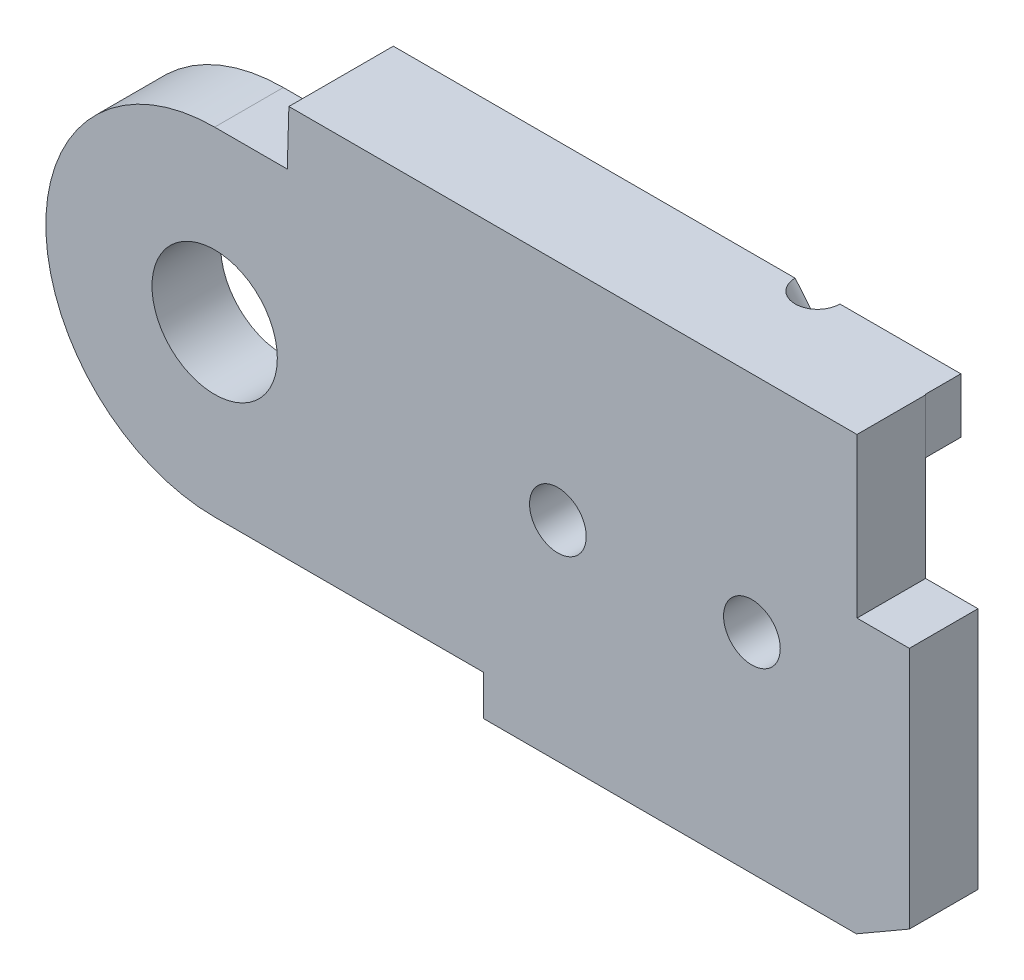
ISO-10303-21;
HEADER;
FILE_DESCRIPTION(('STEP AP214'),'2;1');
FILE_NAME('part.step','',(''),(''),'','','');
FILE_SCHEMA(('AUTOMOTIVE_DESIGN { 1 0 10303 214 1 1 1 1 }'));
ENDSEC;
DATA;
#1=APPLICATION_CONTEXT('core data for automotive mechanical design processes');
#2=APPLICATION_PROTOCOL_DEFINITION('international standard','automotive_design',2000,#1);
#3=PRODUCT_CONTEXT('',#1,'mechanical');
#4=PRODUCT('Part','Part','',(#3));
#5=PRODUCT_RELATED_PRODUCT_CATEGORY('part','',(#4));
#6=PRODUCT_DEFINITION_FORMATION('','',#4);
#7=PRODUCT_DEFINITION_CONTEXT('part definition',#1,'design');
#8=PRODUCT_DEFINITION('design','',#6,#7);
#9=PRODUCT_DEFINITION_SHAPE('','',#8);
#10=(LENGTH_UNIT() NAMED_UNIT(*) SI_UNIT(.MILLI.,.METRE.));
#11=(NAMED_UNIT(*) PLANE_ANGLE_UNIT() SI_UNIT($,.RADIAN.));
#12=(NAMED_UNIT(*) SI_UNIT($,.STERADIAN.) SOLID_ANGLE_UNIT());
#13=UNCERTAINTY_MEASURE_WITH_UNIT(LENGTH_MEASURE(1.E-05),#10,'distance_accuracy_value','');
#14=(GEOMETRIC_REPRESENTATION_CONTEXT(3) GLOBAL_UNCERTAINTY_ASSIGNED_CONTEXT((#13)) GLOBAL_UNIT_ASSIGNED_CONTEXT((#10,
#11,#12)) REPRESENTATION_CONTEXT('',''));
#15=CARTESIAN_POINT('',(0.,0.,0.));
#16=DIRECTION('',(0.,0.,1.));
#17=DIRECTION('',(1.,0.,0.));
#18=AXIS2_PLACEMENT_3D('',#15,#16,#17);
#19=CARTESIAN_POINT('',(0.,0.,11.5));
#20=DIRECTION('',(0.,0.,-1.));
#21=DIRECTION('',(1.,0.,0.));
#22=AXIS2_PLACEMENT_3D('',#19,#20,#21);
#23=PLANE('',#22);
#24=CARTESIAN_POINT('',(11.5,0.,11.5));
#25=DIRECTION('',(0.,0.,1.));
#26=DIRECTION('',(1.,0.,0.));
#27=AXIS2_PLACEMENT_3D('',#24,#25,#26);
#28=CIRCLE('',#27,0.949999999999999);
#29=CARTESIAN_POINT('',(12.45,0.,11.5));
#30=VERTEX_POINT('',#29);
#31=EDGE_CURVE('E399',#30,#30,#28,.T.);
#32=ORIENTED_EDGE('',*,*,#31,.F.);
#33=EDGE_LOOP('',(#32));
#34=FACE_BOUND('',#33,.T.);
#35=CARTESIAN_POINT('',(18.,0.,11.5));
#36=DIRECTION('',(0.,0.,1.));
#37=DIRECTION('',(1.,0.,0.));
#38=AXIS2_PLACEMENT_3D('',#35,#36,#37);
#39=CIRCLE('',#38,0.950000000000001);
#40=CARTESIAN_POINT('',(18.95,0.,11.5));
#41=VERTEX_POINT('',#40);
#42=EDGE_CURVE('E403',#41,#41,#39,.T.);
#43=ORIENTED_EDGE('',*,*,#42,.F.);
#44=EDGE_LOOP('',(#43));
#45=FACE_BOUND('',#44,.T.);
#46=CARTESIAN_POINT('',(0.,0.,11.5));
#47=DIRECTION('',(0.,0.,1.));
#48=DIRECTION('',(1.,0.,0.));
#49=AXIS2_PLACEMENT_3D('',#46,#47,#48);
#50=CIRCLE('',#49,2.1);
#51=CARTESIAN_POINT('',(2.1,0.,11.5));
#52=VERTEX_POINT('',#51);
#53=EDGE_CURVE('E220',#52,#52,#50,.T.);
#54=ORIENTED_EDGE('',*,*,#53,.F.);
#55=EDGE_LOOP('',(#54));
#56=FACE_BOUND('',#55,.T.);
#57=DIRECTION('',(0.,-1.,0.));
#58=VECTOR('',#57,1.);
#59=CARTESIAN_POINT('',(21.5203540034992,0.,11.5));
#60=LINE('',#59,#58);
#61=CARTESIAN_POINT('',(21.5203540034992,7.5,11.5));
#62=VERTEX_POINT('',#61);
#63=CARTESIAN_POINT('',(21.5203540034992,2.1720062451962,11.5));
#64=VERTEX_POINT('',#63);
#65=EDGE_CURVE('E309',#62,#64,#60,.T.);
#66=ORIENTED_EDGE('',*,*,#65,.F.);
#67=DIRECTION('',(-1.,0.,0.));
#68=VECTOR('',#67,1.);
#69=CARTESIAN_POINT('',(27.,7.5,11.5));
#70=LINE('',#69,#68);
#71=CARTESIAN_POINT('',(2.48679014755027,7.5,11.5));
#72=VERTEX_POINT('',#71);
#73=EDGE_CURVE('E272',#62,#72,#70,.T.);
#74=ORIENTED_EDGE('',*,*,#73,.T.);
#75=DIRECTION('',(-0.0293404845923219,-0.999569475306188,0.));
#76=VECTOR('',#75,1.);
#77=CARTESIAN_POINT('',(2.4326880657739,5.65685424949238,11.5));
#78=LINE('',#77,#76);
#79=CARTESIAN_POINT('',(2.4326880657739,5.65685424949238,11.5));
#80=VERTEX_POINT('',#79);
#81=EDGE_CURVE('E276',#72,#80,#78,.T.);
#82=ORIENTED_EDGE('',*,*,#81,.T.);
#83=DIRECTION('',(-1.,0.,0.));
#84=VECTOR('',#83,1.);
#85=CARTESIAN_POINT('',(2.4326880657739,5.65685424949238,11.5));
#86=LINE('',#85,#84);
#87=CARTESIAN_POINT('',(0.,5.65685424949238,11.5));
#88=VERTEX_POINT('',#87);
#89=EDGE_CURVE('E232',#80,#88,#86,.T.);
#90=ORIENTED_EDGE('',*,*,#89,.T.);
#91=CARTESIAN_POINT('',(0.,0.,11.5));
#92=DIRECTION('',(0.,0.,1.));
#93=DIRECTION('',(1.,0.,0.));
#94=AXIS2_PLACEMENT_3D('',#91,#92,#93);
#95=CIRCLE('',#94,5.65685424949238);
#96=CARTESIAN_POINT('',(0.,-5.65685424949238,11.5));
#97=VERTEX_POINT('',#96);
#98=EDGE_CURVE('E224',#88,#97,#95,.T.);
#99=ORIENTED_EDGE('',*,*,#98,.T.);
#100=DIRECTION('',(1.,0.,0.));
#101=VECTOR('',#100,1.);
#102=CARTESIAN_POINT('',(9.,-5.65685424949238,11.5));
#103=LINE('',#102,#101);
#104=CARTESIAN_POINT('',(9.,-5.65685424949238,11.5));
#105=VERTEX_POINT('',#104);
#106=EDGE_CURVE('E252',#97,#105,#103,.T.);
#107=ORIENTED_EDGE('',*,*,#106,.T.);
#108=DIRECTION('',(0.,-1.,0.));
#109=VECTOR('',#108,1.);
#110=CARTESIAN_POINT('',(9.,-6.99999999999999,11.5));
#111=LINE('',#110,#109);
#112=CARTESIAN_POINT('',(9.,-6.99999999999999,11.5));
#113=VERTEX_POINT('',#112);
#114=EDGE_CURVE('E256',#105,#113,#111,.T.);
#115=ORIENTED_EDGE('',*,*,#114,.T.);
#116=DIRECTION('',(1.,0.,0.));
#117=VECTOR('',#116,1.);
#118=CARTESIAN_POINT('',(9.,-6.99999999999999,11.5));
#119=LINE('',#118,#117);
#120=CARTESIAN_POINT('',(21.5,-6.99999999999999,11.5));
#121=VERTEX_POINT('',#120);
#122=EDGE_CURVE('E260',#113,#121,#119,.T.);
#123=ORIENTED_EDGE('',*,*,#122,.T.);
#124=DIRECTION('',(0.865971186561437,0.500093895229063,0.));
#125=VECTOR('',#124,1.);
#126=CARTESIAN_POINT('',(21.5,-6.99999999999999,11.5));
#127=LINE('',#126,#125);
#128=CARTESIAN_POINT('',(23.2751262658471,-5.97487373415292,11.5));
#129=VERTEX_POINT('',#128);
#130=EDGE_CURVE('E264',#121,#129,#127,.T.);
#131=ORIENTED_EDGE('',*,*,#130,.T.);
#132=DIRECTION('',(0.,1.,0.));
#133=VECTOR('',#132,1.);
#134=CARTESIAN_POINT('',(23.2751262658471,-5.97487373415292,11.5));
#135=LINE('',#134,#133);
#136=CARTESIAN_POINT('',(23.2751262658471,2.1720062451962,11.5));
#137=VERTEX_POINT('',#136);
#138=EDGE_CURVE('E268',#129,#137,#135,.T.);
#139=ORIENTED_EDGE('',*,*,#138,.T.);
#140=DIRECTION('',(1.,0.,0.));
#141=VECTOR('',#140,1.);
#142=CARTESIAN_POINT('',(0.,2.1720062451962,11.5));
#143=LINE('',#142,#141);
#144=EDGE_CURVE('E313',#64,#137,#143,.T.);
#145=ORIENTED_EDGE('',*,*,#144,.F.);
#146=EDGE_LOOP('',(#66,#74,#82,#90,#99,#107,#115,#123,#131,#139,#145));
#147=FACE_BOUND('',#146,.T.);
#148=ADVANCED_FACE('F42',(#34,#45,#56,#147),#23,.F.);
#149=CARTESIAN_POINT('',(11.5,0.,8.));
#150=DIRECTION('',(0.,0.,1.));
#151=DIRECTION('',(-1.,0.,0.));
#152=AXIS2_PLACEMENT_3D('',#149,#150,#151);
#153=CYLINDRICAL_SURFACE('',#152,2.5);
#154=CARTESIAN_POINT('',(11.5,0.,8.));
#155=DIRECTION('',(0.,0.,1.));
#156=DIRECTION('',(1.,0.,0.));
#157=AXIS2_PLACEMENT_3D('',#154,#155,#156);
#158=CIRCLE('',#157,2.5);
#159=CARTESIAN_POINT('',(14.,0.,8.));
#160=VERTEX_POINT('',#159);
#161=EDGE_CURVE('E383',#160,#160,#158,.T.);
#162=ORIENTED_EDGE('',*,*,#161,.T.);
#163=EDGE_LOOP('',(#162));
#164=FACE_BOUND('',#163,.T.);
#165=CARTESIAN_POINT('',(11.5,0.,9.2));
#166=DIRECTION('',(0.,0.,1.));
#167=DIRECTION('',(1.,0.,0.));
#168=AXIS2_PLACEMENT_3D('',#165,#166,#167);
#169=CIRCLE('',#168,2.5);
#170=CARTESIAN_POINT('',(14.,0.,9.2));
#171=VERTEX_POINT('',#170);
#172=EDGE_CURVE('E387',#171,#171,#169,.T.);
#173=ORIENTED_EDGE('',*,*,#172,.F.);
#174=EDGE_LOOP('',(#173));
#175=FACE_BOUND('',#174,.T.);
#176=ADVANCED_FACE('F462',(#164,#175),#153,.T.);
#177=CARTESIAN_POINT('',(18.,0.,8.));
#178=DIRECTION('',(0.,0.,1.));
#179=DIRECTION('',(-1.,0.,0.));
#180=AXIS2_PLACEMENT_3D('',#177,#178,#179);
#181=CYLINDRICAL_SURFACE('',#180,2.5);
#182=CARTESIAN_POINT('',(18.,0.,8.));
#183=DIRECTION('',(0.,0.,1.));
#184=DIRECTION('',(1.,0.,0.));
#185=AXIS2_PLACEMENT_3D('',#182,#183,#184);
#186=CIRCLE('',#185,2.5);
#187=CARTESIAN_POINT('',(20.5,0.,8.));
#188=VERTEX_POINT('',#187);
#189=EDGE_CURVE('E391',#188,#188,#186,.T.);
#190=ORIENTED_EDGE('',*,*,#189,.T.);
#191=EDGE_LOOP('',(#190));
#192=FACE_BOUND('',#191,.T.);
#193=CARTESIAN_POINT('',(18.,0.,9.2));
#194=DIRECTION('',(0.,0.,1.));
#195=DIRECTION('',(1.,0.,0.));
#196=AXIS2_PLACEMENT_3D('',#193,#194,#195);
#197=CIRCLE('',#196,2.5);
#198=CARTESIAN_POINT('',(20.5,0.,9.2));
#199=VERTEX_POINT('',#198);
#200=EDGE_CURVE('E395',#199,#199,#197,.T.);
#201=ORIENTED_EDGE('',*,*,#200,.F.);
#202=EDGE_LOOP('',(#201));
#203=FACE_BOUND('',#202,.T.);
#204=ADVANCED_FACE('F468',(#192,#203),#181,.T.);
#205=CARTESIAN_POINT('',(27.,2.1720062451962,11.6));
#206=DIRECTION('',(0.,-1.,0.));
#207=DIRECTION('',(0.,0.,1.));
#208=AXIS2_PLACEMENT_3D('',#205,#206,#207);
#209=PLANE('',#208);
#210=ORIENTED_EDGE('',*,*,#144,.T.);
#211=DIRECTION('',(0.,0.,1.));
#212=VECTOR('',#211,1.);
#213=CARTESIAN_POINT('',(23.2751262658471,2.1720062451962,9.2));
#214=LINE('',#213,#212);
#215=CARTESIAN_POINT('',(23.2751262658471,2.1720062451962,9.2));
#216=VERTEX_POINT('',#215);
#217=EDGE_CURVE('E291',#216,#137,#214,.T.);
#218=ORIENTED_EDGE('',*,*,#217,.F.);
#219=DIRECTION('',(1.,0.,0.));
#220=VECTOR('',#219,1.);
#221=CARTESIAN_POINT('',(27.,2.1720062451962,9.2));
#222=LINE('',#221,#220);
#223=CARTESIAN_POINT('',(21.5203540034992,2.1720062451962,9.2));
#224=VERTEX_POINT('',#223);
#225=EDGE_CURVE('E380',#224,#216,#222,.T.);
#226=ORIENTED_EDGE('',*,*,#225,.F.);
#227=DIRECTION('',(0.,0.,-1.));
#228=VECTOR('',#227,1.);
#229=CARTESIAN_POINT('',(21.5203540034992,2.1720062451962,11.6));
#230=LINE('',#229,#228);
#231=EDGE_CURVE('E65',#64,#224,#230,.T.);
#232=ORIENTED_EDGE('',*,*,#231,.F.);
#233=EDGE_LOOP('',(#210,#218,#226,#232));
#234=FACE_BOUND('',#233,.T.);
#235=ADVANCED_FACE('F438',(#234),#209,.F.);
#236=CARTESIAN_POINT('',(23.2751262658471,-5.97487373415292,9.2));
#237=DIRECTION('',(-1.,0.,0.));
#238=DIRECTION('',(0.,0.,-1.));
#239=AXIS2_PLACEMENT_3D('',#236,#237,#238);
#240=PLANE('',#239);
#241=ORIENTED_EDGE('',*,*,#138,.F.);
#242=DIRECTION('',(0.,0.,1.));
#243=VECTOR('',#242,1.);
#244=CARTESIAN_POINT('',(23.2751262658471,-5.97487373415292,9.2));
#245=LINE('',#244,#243);
#246=CARTESIAN_POINT('',(23.2751262658471,-5.97487373415292,9.2));
#247=VERTEX_POINT('',#246);
#248=EDGE_CURVE('E294',#247,#129,#245,.T.);
#249=ORIENTED_EDGE('',*,*,#248,.F.);
#250=DIRECTION('',(0.,1.,0.));
#251=VECTOR('',#250,1.);
#252=CARTESIAN_POINT('',(23.2751262658471,-5.97487373415292,9.2));
#253=LINE('',#252,#251);
#254=EDGE_CURVE('E238',#247,#216,#253,.T.);
#255=ORIENTED_EDGE('',*,*,#254,.T.);
#256=ORIENTED_EDGE('',*,*,#217,.T.);
#257=EDGE_LOOP('',(#241,#249,#255,#256));
#258=FACE_BOUND('',#257,.T.);
#259=ADVANCED_FACE('F434',(#258),#240,.F.);
#260=CARTESIAN_POINT('',(21.5,-6.99999999999999,8.));
#261=DIRECTION('',(-1.,0.,0.));
#262=DIRECTION('',(0.,0.,-1.));
#263=AXIS2_PLACEMENT_3D('',#260,#261,#262);
#264=PLANE('',#263);
#265=DIRECTION('',(0.,1.,0.));
#266=VECTOR('',#265,1.);
#267=CARTESIAN_POINT('',(21.5,-6.99999999999999,9.2));
#268=LINE('',#267,#266);
#269=CARTESIAN_POINT('',(21.5,-6.99999999999999,9.2));
#270=VERTEX_POINT('',#269);
#271=CARTESIAN_POINT('',(21.5,-5.65685424949238,9.2));
#272=VERTEX_POINT('',#271);
#273=EDGE_CURVE('E363',#270,#272,#268,.T.);
#274=ORIENTED_EDGE('',*,*,#273,.F.);
#275=DIRECTION('',(0.,0.,1.));
#276=VECTOR('',#275,1.);
#277=CARTESIAN_POINT('',(21.5,-6.99999999999999,8.));
#278=LINE('',#277,#276);
#279=CARTESIAN_POINT('',(21.5,-6.99999999999999,8.));
#280=VERTEX_POINT('',#279);
#281=EDGE_CURVE('E341',#280,#270,#278,.T.);
#282=ORIENTED_EDGE('',*,*,#281,.F.);
#283=DIRECTION('',(0.,1.,0.));
#284=VECTOR('',#283,1.);
#285=CARTESIAN_POINT('',(21.5,-6.99999999999999,8.));
#286=LINE('',#285,#284);
#287=CARTESIAN_POINT('',(21.5,-5.65685424949238,8.));
#288=VERTEX_POINT('',#287);
#289=EDGE_CURVE('E348',#280,#288,#286,.T.);
#290=ORIENTED_EDGE('',*,*,#289,.T.);
#291=DIRECTION('',(0.,0.,1.));
#292=VECTOR('',#291,1.);
#293=CARTESIAN_POINT('',(21.5,-5.65685424949238,8.));
#294=LINE('',#293,#292);
#295=EDGE_CURVE('E344',#288,#272,#294,.T.);
#296=ORIENTED_EDGE('',*,*,#295,.T.);
#297=EDGE_LOOP('',(#274,#282,#290,#296));
#298=FACE_BOUND('',#297,.T.);
#299=ADVANCED_FACE('F437',(#298),#264,.F.);
#300=CARTESIAN_POINT('',(21.5,-6.99999999999999,9.2));
#301=DIRECTION('',(-0.500093895229063,0.865971186561437,0.));
#302=DIRECTION('',(-0.865971186561437,-0.500093895229063,0.));
#303=AXIS2_PLACEMENT_3D('',#300,#301,#302);
#304=PLANE('',#303);
#305=ORIENTED_EDGE('',*,*,#130,.F.);
#306=DIRECTION('',(0.,0.,1.));
#307=VECTOR('',#306,1.);
#308=CARTESIAN_POINT('',(21.5,-6.99999999999999,9.2));
#309=LINE('',#308,#307);
#310=EDGE_CURVE('E297',#270,#121,#309,.T.);
#311=ORIENTED_EDGE('',*,*,#310,.F.);
#312=DIRECTION('',(0.865971186561437,0.500093895229063,0.));
#313=VECTOR('',#312,1.);
#314=CARTESIAN_POINT('',(21.5,-6.99999999999999,9.2));
#315=LINE('',#314,#313);
#316=EDGE_CURVE('E235',#270,#247,#315,.T.);
#317=ORIENTED_EDGE('',*,*,#316,.T.);
#318=ORIENTED_EDGE('',*,*,#248,.T.);
#319=EDGE_LOOP('',(#305,#311,#317,#318));
#320=FACE_BOUND('',#319,.T.);
#321=ADVANCED_FACE('F440',(#320),#304,.F.);
#322=CARTESIAN_POINT('',(21.5,-5.65685424949238,8.));
#323=DIRECTION('',(0.,-1.,0.));
#324=DIRECTION('',(0.,0.,1.));
#325=AXIS2_PLACEMENT_3D('',#322,#323,#324);
#326=PLANE('',#325);
#327=DIRECTION('',(-1.,0.,0.));
#328=VECTOR('',#327,1.);
#329=CARTESIAN_POINT('',(21.5,-5.65685424949238,9.2));
#330=LINE('',#329,#328);
#331=CARTESIAN_POINT('',(9.,-5.65685424949238,9.2));
#332=VERTEX_POINT('',#331);
#333=EDGE_CURVE('E367',#272,#332,#330,.T.);
#334=ORIENTED_EDGE('',*,*,#333,.F.);
#335=ORIENTED_EDGE('',*,*,#295,.F.);
#336=DIRECTION('',(-1.,0.,0.));
#337=VECTOR('',#336,1.);
#338=CARTESIAN_POINT('',(21.5,-5.65685424949238,8.));
#339=LINE('',#338,#337);
#340=CARTESIAN_POINT('',(9.,-5.65685424949238,8.));
#341=VERTEX_POINT('',#340);
#342=EDGE_CURVE('E359',#288,#341,#339,.T.);
#343=ORIENTED_EDGE('',*,*,#342,.T.);
#344=DIRECTION('',(0.,0.,1.));
#345=VECTOR('',#344,1.);
#346=CARTESIAN_POINT('',(9.,-5.65685424949238,8.));
#347=LINE('',#346,#345);
#348=EDGE_CURVE('E207',#341,#332,#347,.T.);
#349=ORIENTED_EDGE('',*,*,#348,.T.);
#350=EDGE_LOOP('',(#334,#335,#343,#349));
#351=FACE_BOUND('',#350,.T.);
#352=ADVANCED_FACE('F443',(#351),#326,.F.);
#353=CARTESIAN_POINT('',(0.,0.,8.));
#354=DIRECTION('',(0.,0.,-1.));
#355=DIRECTION('',(1.,0.,0.));
#356=AXIS2_PLACEMENT_3D('',#353,#354,#355);
#357=PLANE('',#356);
#358=ORIENTED_EDGE('',*,*,#342,.F.);
#359=ORIENTED_EDGE('',*,*,#289,.F.);
#360=DIRECTION('',(1.,0.,0.));
#361=VECTOR('',#360,1.);
#362=CARTESIAN_POINT('',(9.,-6.99999999999999,8.));
#363=LINE('',#362,#361);
#364=CARTESIAN_POINT('',(9.,-6.99999999999999,8.));
#365=VERTEX_POINT('',#364);
#366=EDGE_CURVE('E352',#365,#280,#363,.T.);
#367=ORIENTED_EDGE('',*,*,#366,.F.);
#368=DIRECTION('',(0.,-1.,0.));
#369=VECTOR('',#368,1.);
#370=CARTESIAN_POINT('',(9.,-5.65685424949238,8.));
#371=LINE('',#370,#369);
#372=EDGE_CURVE('E355',#341,#365,#371,.T.);
#373=ORIENTED_EDGE('',*,*,#372,.F.);
#374=EDGE_LOOP('',(#358,#359,#367,#373));
#375=FACE_BOUND('',#374,.T.);
#376=ADVANCED_FACE('F449',(#375),#357,.T.);
#377=CARTESIAN_POINT('',(9.,-6.99999999999999,9.2));
#378=DIRECTION('',(0.,1.,0.));
#379=DIRECTION('',(-1.,0.,0.));
#380=AXIS2_PLACEMENT_3D('',#377,#378,#379);
#381=PLANE('',#380);
#382=ORIENTED_EDGE('',*,*,#122,.F.);
#383=DIRECTION('',(0.,0.,1.));
#384=VECTOR('',#383,1.);
#385=CARTESIAN_POINT('',(9.,-6.99999999999999,9.2));
#386=LINE('',#385,#384);
#387=EDGE_CURVE('E300',#365,#113,#386,.T.);
#388=ORIENTED_EDGE('',*,*,#387,.F.);
#389=ORIENTED_EDGE('',*,*,#366,.T.);
#390=ORIENTED_EDGE('',*,*,#281,.T.);
#391=ORIENTED_EDGE('',*,*,#310,.T.);
#392=EDGE_LOOP('',(#382,#388,#389,#390,#391));
#393=FACE_BOUND('',#392,.T.);
#394=ADVANCED_FACE('F445',(#393),#381,.F.);
#395=CARTESIAN_POINT('',(9.,-6.99999999999999,9.2));
#396=DIRECTION('',(1.,0.,0.));
#397=DIRECTION('',(0.,0.,1.));
#398=AXIS2_PLACEMENT_3D('',#395,#396,#397);
#399=PLANE('',#398);
#400=ORIENTED_EDGE('',*,*,#114,.F.);
#401=DIRECTION('',(0.,0.,1.));
#402=VECTOR('',#401,1.);
#403=CARTESIAN_POINT('',(9.,-5.65685424949238,9.2));
#404=LINE('',#403,#402);
#405=EDGE_CURVE('E303',#332,#105,#404,.T.);
#406=ORIENTED_EDGE('',*,*,#405,.F.);
#407=ORIENTED_EDGE('',*,*,#348,.F.);
#408=ORIENTED_EDGE('',*,*,#372,.T.);
#409=ORIENTED_EDGE('',*,*,#387,.T.);
#410=EDGE_LOOP('',(#400,#406,#407,#408,#409));
#411=FACE_BOUND('',#410,.T.);
#412=ADVANCED_FACE('F448',(#411),#399,.F.);
#413=CARTESIAN_POINT('',(9.,-5.65685424949238,9.2));
#414=DIRECTION('',(0.,1.,0.));
#415=DIRECTION('',(0.,0.,-1.));
#416=AXIS2_PLACEMENT_3D('',#413,#414,#415);
#417=PLANE('',#416);
#418=ORIENTED_EDGE('',*,*,#106,.F.);
#419=DIRECTION('',(0.,0.,1.));
#420=VECTOR('',#419,1.);
#421=CARTESIAN_POINT('',(0.,-5.65685424949238,9.2));
#422=LINE('',#421,#420);
#423=CARTESIAN_POINT('',(0.,-5.65685424949238,9.2));
#424=VERTEX_POINT('',#423);
#425=EDGE_CURVE('E306',#424,#97,#422,.T.);
#426=ORIENTED_EDGE('',*,*,#425,.F.);
#427=DIRECTION('',(1.,0.,0.));
#428=VECTOR('',#427,1.);
#429=CARTESIAN_POINT('',(9.,-5.65685424949238,9.2));
#430=LINE('',#429,#428);
#431=EDGE_CURVE('E231',#424,#332,#430,.T.);
#432=ORIENTED_EDGE('',*,*,#431,.T.);
#433=ORIENTED_EDGE('',*,*,#405,.T.);
#434=EDGE_LOOP('',(#418,#426,#432,#433));
#435=FACE_BOUND('',#434,.T.);
#436=ADVANCED_FACE('F452',(#435),#417,.F.);
#437=CARTESIAN_POINT('',(0.,0.,9.2));
#438=DIRECTION('',(0.,0.,1.));
#439=DIRECTION('',(-1.,0.,0.));
#440=AXIS2_PLACEMENT_3D('',#437,#438,#439);
#441=CYLINDRICAL_SURFACE('',#440,5.65685424949238);
#442=ORIENTED_EDGE('',*,*,#98,.F.);
#443=DIRECTION('',(0.,0.,1.));
#444=VECTOR('',#443,1.);
#445=CARTESIAN_POINT('',(0.,5.65685424949238,9.2));
#446=LINE('',#445,#444);
#447=CARTESIAN_POINT('',(0.,5.65685424949238,9.2));
#448=VERTEX_POINT('',#447);
#449=EDGE_CURVE('E248',#448,#88,#446,.T.);
#450=ORIENTED_EDGE('',*,*,#449,.F.);
#451=CARTESIAN_POINT('',(0.,0.,9.2));
#452=DIRECTION('',(0.,0.,1.));
#453=DIRECTION('',(1.,0.,0.));
#454=AXIS2_PLACEMENT_3D('',#451,#452,#453);
#455=CIRCLE('',#454,5.65685424949238);
#456=EDGE_CURVE('E228',#448,#424,#455,.T.);
#457=ORIENTED_EDGE('',*,*,#456,.T.);
#458=ORIENTED_EDGE('',*,*,#425,.T.);
#459=EDGE_LOOP('',(#442,#450,#457,#458));
#460=FACE_BOUND('',#459,.T.);
#461=ADVANCED_FACE('F44',(#460),#441,.T.);
#462=CARTESIAN_POINT('',(2.4326880657739,5.65685424949238,8.));
#463=DIRECTION('',(0.,1.,0.));
#464=DIRECTION('',(0.,0.,-1.));
#465=AXIS2_PLACEMENT_3D('',#462,#463,#464);
#466=PLANE('',#465);
#467=DIRECTION('',(1.,0.,0.));
#468=VECTOR('',#467,1.);
#469=CARTESIAN_POINT('',(2.4326880657739,5.65685424949238,8.));
#470=LINE('',#469,#468);
#471=CARTESIAN_POINT('',(18.9854768194204,5.65685424949238,8.));
#472=VERTEX_POINT('',#471);
#473=CARTESIAN_POINT('',(21.5,5.65685424949238,8.));
#474=VERTEX_POINT('',#473);
#475=EDGE_CURVE('E187',#472,#474,#470,.T.);
#476=ORIENTED_EDGE('',*,*,#475,.T.);
#477=DIRECTION('',(0.,0.,1.));
#478=VECTOR('',#477,1.);
#479=CARTESIAN_POINT('',(21.5,5.65685424949238,8.));
#480=LINE('',#479,#478);
#481=CARTESIAN_POINT('',(21.5,5.65685424949238,9.2));
#482=VERTEX_POINT('',#481);
#483=EDGE_CURVE('E213',#474,#482,#480,.T.);
#484=ORIENTED_EDGE('',*,*,#483,.T.);
#485=DIRECTION('',(1.,0.,0.));
#486=VECTOR('',#485,1.);
#487=CARTESIAN_POINT('',(2.4326880657739,5.65685424949238,9.2));
#488=LINE('',#487,#486);
#489=CARTESIAN_POINT('',(2.4326880657739,5.65685424949238,9.2));
#490=VERTEX_POINT('',#489);
#491=EDGE_CURVE('E202',#490,#482,#488,.T.);
#492=ORIENTED_EDGE('',*,*,#491,.F.);
#493=DIRECTION('',(0.,0.,1.));
#494=VECTOR('',#493,1.);
#495=CARTESIAN_POINT('',(2.4326880657739,5.65685424949238,8.));
#496=LINE('',#495,#494);
#497=CARTESIAN_POINT('',(2.4326880657739,5.65685424949238,8.));
#498=VERTEX_POINT('',#497);
#499=EDGE_CURVE('E184',#498,#490,#496,.T.);
#500=ORIENTED_EDGE('',*,*,#499,.F.);
#501=CARTESIAN_POINT('',(17.4854768194204,5.65685424949238,8.));
#502=VERTEX_POINT('',#501);
#503=EDGE_CURVE('E169',#498,#502,#470,.T.);
#504=ORIENTED_EDGE('',*,*,#503,.T.);
#505=CARTESIAN_POINT('',(18.2354768194204,5.65685424949238,8.));
#506=DIRECTION('',(0.,1.,0.));
#507=DIRECTION('',(0.,0.,1.));
#508=AXIS2_PLACEMENT_3D('',#505,#506,#507);
#509=CIRCLE('',#508,0.750000000000002);
#510=EDGE_CURVE('E173',#502,#472,#509,.T.);
#511=ORIENTED_EDGE('',*,*,#510,.T.);
#512=EDGE_LOOP('',(#476,#484,#492,#500,#504,#511));
#513=FACE_BOUND('',#512,.T.);
#514=ADVANCED_FACE('F181',(#513),#466,.F.);
#515=CARTESIAN_POINT('',(2.4326880657739,5.65685424949238,9.2));
#516=DIRECTION('',(0.,-1.,0.));
#517=DIRECTION('',(0.,0.,1.));
#518=AXIS2_PLACEMENT_3D('',#515,#516,#517);
#519=PLANE('',#518);
#520=ORIENTED_EDGE('',*,*,#89,.F.);
#521=DIRECTION('',(0.,0.,1.));
#522=VECTOR('',#521,1.);
#523=CARTESIAN_POINT('',(2.4326880657739,5.65685424949238,9.2));
#524=LINE('',#523,#522);
#525=EDGE_CURVE('E285',#490,#80,#524,.T.);
#526=ORIENTED_EDGE('',*,*,#525,.F.);
#527=DIRECTION('',(-1.,0.,0.));
#528=VECTOR('',#527,1.);
#529=CARTESIAN_POINT('',(2.4326880657739,5.65685424949238,9.2));
#530=LINE('',#529,#528);
#531=EDGE_CURVE('E245',#490,#448,#530,.T.);
#532=ORIENTED_EDGE('',*,*,#531,.T.);
#533=ORIENTED_EDGE('',*,*,#449,.T.);
#534=EDGE_LOOP('',(#520,#526,#532,#533));
#535=FACE_BOUND('',#534,.T.);
#536=ADVANCED_FACE('F332',(#535),#519,.F.);
#537=CARTESIAN_POINT('',(2.4326880657739,5.65685424949238,9.2));
#538=DIRECTION('',(0.999569475306188,-0.0293404845923219,0.));
#539=DIRECTION('',(0.0293404845923219,0.999569475306188,0.));
#540=AXIS2_PLACEMENT_3D('',#537,#538,#539);
#541=PLANE('',#540);
#542=ORIENTED_EDGE('',*,*,#81,.F.);
#543=DIRECTION('',(0.,0.,1.));
#544=VECTOR('',#543,1.);
#545=CARTESIAN_POINT('',(2.48679014755027,7.5,9.2));
#546=LINE('',#545,#544);
#547=CARTESIAN_POINT('',(2.48679014755027,7.5,8.));
#548=VERTEX_POINT('',#547);
#549=EDGE_CURVE('E288',#548,#72,#546,.T.);
#550=ORIENTED_EDGE('',*,*,#549,.F.);
#551=DIRECTION('',(-0.0293404845923219,-0.999569475306188,0.));
#552=VECTOR('',#551,1.);
#553=CARTESIAN_POINT('',(2.48679014755027,7.5,8.));
#554=LINE('',#553,#552);
#555=EDGE_CURVE('E193',#548,#498,#554,.T.);
#556=ORIENTED_EDGE('',*,*,#555,.T.);
#557=ORIENTED_EDGE('',*,*,#499,.T.);
#558=ORIENTED_EDGE('',*,*,#525,.T.);
#559=EDGE_LOOP('',(#542,#550,#556,#557,#558));
#560=FACE_BOUND('',#559,.T.);
#561=ADVANCED_FACE('F335',(#560),#541,.F.);
#562=CARTESIAN_POINT('',(21.5203540034992,2.1720062451962,11.6));
#563=DIRECTION('',(-1.,0.,0.));
#564=DIRECTION('',(0.,0.,-1.));
#565=AXIS2_PLACEMENT_3D('',#562,#563,#564);
#566=PLANE('',#565);
#567=DIRECTION('',(0.,0.,-1.));
#568=VECTOR('',#567,1.);
#569=CARTESIAN_POINT('',(21.5203540034992,7.5,11.6));
#570=LINE('',#569,#568);
#571=CARTESIAN_POINT('',(21.5203540034992,7.5,9.2));
#572=VERTEX_POINT('',#571);
#573=EDGE_CURVE('E373',#62,#572,#570,.T.);
#574=ORIENTED_EDGE('',*,*,#573,.F.);
#575=ORIENTED_EDGE('',*,*,#65,.T.);
#576=ORIENTED_EDGE('',*,*,#231,.T.);
#577=DIRECTION('',(0.,-1.,0.));
#578=VECTOR('',#577,1.);
#579=CARTESIAN_POINT('',(21.5203540034992,2.1720062451962,9.2));
#580=LINE('',#579,#578);
#581=EDGE_CURVE('E377',#572,#224,#580,.T.);
#582=ORIENTED_EDGE('',*,*,#581,.F.);
#583=EDGE_LOOP('',(#574,#575,#576,#582));
#584=FACE_BOUND('',#583,.T.);
#585=ADVANCED_FACE('F480',(#584),#566,.F.);
#586=CARTESIAN_POINT('',(0.,0.,9.2));
#587=DIRECTION('',(0.,0.,-1.));
#588=DIRECTION('',(1.,0.,0.));
#589=AXIS2_PLACEMENT_3D('',#586,#587,#588);
#590=PLANE('',#589);
#591=ORIENTED_EDGE('',*,*,#200,.T.);
#592=EDGE_LOOP('',(#591));
#593=FACE_BOUND('',#592,.T.);
#594=ORIENTED_EDGE('',*,*,#172,.T.);
#595=EDGE_LOOP('',(#594));
#596=FACE_BOUND('',#595,.T.);
#597=ORIENTED_EDGE('',*,*,#225,.T.);
#598=ORIENTED_EDGE('',*,*,#254,.F.);
#599=ORIENTED_EDGE('',*,*,#316,.F.);
#600=ORIENTED_EDGE('',*,*,#273,.T.);
#601=ORIENTED_EDGE('',*,*,#333,.T.);
#602=ORIENTED_EDGE('',*,*,#431,.F.);
#603=ORIENTED_EDGE('',*,*,#456,.F.);
#604=ORIENTED_EDGE('',*,*,#531,.F.);
#605=ORIENTED_EDGE('',*,*,#491,.T.);
#606=DIRECTION('',(0.,1.,0.));
#607=VECTOR('',#606,1.);
#608=CARTESIAN_POINT('',(21.5,5.65685424949238,9.2));
#609=LINE('',#608,#607);
#610=CARTESIAN_POINT('',(21.5,7.5,9.2));
#611=VERTEX_POINT('',#610);
#612=EDGE_CURVE('E206',#482,#611,#609,.T.);
#613=ORIENTED_EDGE('',*,*,#612,.T.);
#614=DIRECTION('',(-1.,0.,0.));
#615=VECTOR('',#614,1.);
#616=CARTESIAN_POINT('',(27.,7.5,9.2));
#617=LINE('',#616,#615);
#618=EDGE_CURVE('E241',#572,#611,#617,.T.);
#619=ORIENTED_EDGE('',*,*,#618,.F.);
#620=ORIENTED_EDGE('',*,*,#581,.T.);
#621=EDGE_LOOP('',(#597,#598,#599,#600,#601,#602,#603,#604,#605,#613,#619,#620));
#622=FACE_BOUND('',#621,.T.);
#623=CARTESIAN_POINT('',(0.,0.,9.2));
#624=DIRECTION('',(0.,0.,1.));
#625=DIRECTION('',(1.,0.,0.));
#626=AXIS2_PLACEMENT_3D('',#623,#624,#625);
#627=CIRCLE('',#626,2.1);
#628=CARTESIAN_POINT('',(2.1,0.,9.2));
#629=VERTEX_POINT('',#628);
#630=EDGE_CURVE('E219',#629,#629,#627,.T.);
#631=ORIENTED_EDGE('',*,*,#630,.T.);
#632=EDGE_LOOP('',(#631));
#633=FACE_BOUND('',#632,.T.);
#634=ADVANCED_FACE('F324',(#593,#596,#622,#633),#590,.T.);
#635=CARTESIAN_POINT('',(21.5,5.65685424949238,8.));
#636=DIRECTION('',(-1.,0.,0.));
#637=DIRECTION('',(0.,0.,-1.));
#638=AXIS2_PLACEMENT_3D('',#635,#636,#637);
#639=PLANE('',#638);
#640=ORIENTED_EDGE('',*,*,#612,.F.);
#641=ORIENTED_EDGE('',*,*,#483,.F.);
#642=DIRECTION('',(0.,1.,0.));
#643=VECTOR('',#642,1.);
#644=CARTESIAN_POINT('',(21.5,5.65685424949238,8.));
#645=LINE('',#644,#643);
#646=CARTESIAN_POINT('',(21.5,7.5,8.));
#647=VERTEX_POINT('',#646);
#648=EDGE_CURVE('E186',#474,#647,#645,.T.);
#649=ORIENTED_EDGE('',*,*,#648,.T.);
#650=DIRECTION('',(0.,0.,1.));
#651=VECTOR('',#650,1.);
#652=CARTESIAN_POINT('',(21.5,7.5,8.));
#653=LINE('',#652,#651);
#654=EDGE_CURVE('E201',#647,#611,#653,.T.);
#655=ORIENTED_EDGE('',*,*,#654,.T.);
#656=EDGE_LOOP('',(#640,#641,#649,#655));
#657=FACE_BOUND('',#656,.T.);
#658=ADVANCED_FACE('F321',(#657),#639,.F.);
#659=CARTESIAN_POINT('',(0.,0.,8.));
#660=DIRECTION('',(0.,0.,-1.));
#661=DIRECTION('',(1.,0.,0.));
#662=AXIS2_PLACEMENT_3D('',#659,#660,#661);
#663=PLANE('',#662);
#664=DIRECTION('',(0.640410196211525,-0.768033059567306,0.));
#665=VECTOR('',#664,1.);
#666=CARTESIAN_POINT('',(12.5813748573051,13.3371848451654,8.));
#667=LINE('',#666,#665);
#668=CARTESIAN_POINT('',(17.4486037421156,7.5,8.));
#669=VERTEX_POINT('',#668);
#670=EDGE_CURVE('E51',#472,#669,#667,.F.);
#671=ORIENTED_EDGE('',*,*,#670,.T.);
#672=DIRECTION('',(-1.,0.,0.));
#673=VECTOR('',#672,1.);
#674=CARTESIAN_POINT('',(2.48679014755027,7.5,8.));
#675=LINE('',#674,#673);
#676=EDGE_CURVE('E197',#647,#669,#675,.T.);
#677=ORIENTED_EDGE('',*,*,#676,.F.);
#678=ORIENTED_EDGE('',*,*,#648,.F.);
#679=ORIENTED_EDGE('',*,*,#475,.F.);
#680=EDGE_LOOP('',(#671,#677,#678,#679));
#681=FACE_BOUND('',#680,.T.);
#682=ADVANCED_FACE('F317',(#681),#663,.T.);
#683=CARTESIAN_POINT('',(11.8313748573051,13.3371848451654,8.));
#684=DIRECTION('',(0.,1.,0.));
#685=DIRECTION('',(0.,0.,1.));
#686=AXIS2_PLACEMENT_3D('',#683,#684,#685);
#687=CIRCLE('',#686,0.750000000000002);
#688=DIRECTION('',(0.640410196211525,-0.768033059567306,0.));
#689=VECTOR('',#688,1.);
#690=SURFACE_OF_LINEAR_EXTRUSION('',#687,#689);
#691=DIRECTION('',(0.640410196211525,-0.768033059567306,0.));
#692=VECTOR('',#691,1.);
#693=CARTESIAN_POINT('',(11.0813748573051,13.3371848451654,8.));
#694=LINE('',#693,#692);
#695=CARTESIAN_POINT('',(15.9486037421156,7.5,8.));
#696=VERTEX_POINT('',#695);
#697=EDGE_CURVE('E12',#696,#502,#694,.T.);
#698=ORIENTED_EDGE('',*,*,#697,.F.);
#699=CARTESIAN_POINT('',(15.9486037421156,7.5,8.));
#700=CARTESIAN_POINT('',(15.9485828223259,7.5,8.0370057819981));
#701=CARTESIAN_POINT('',(15.9513415433594,7.5,8.07400519117771));
#702=CARTESIAN_POINT('',(15.9622658553059,7.5,8.14719785154291));
#703=CARTESIAN_POINT('',(15.9704314462188,7.5,8.18339110272848));
#704=CARTESIAN_POINT('',(15.9921393934185,7.5,8.25457912342609));
#705=CARTESIAN_POINT('',(16.0057416320877,7.5,8.28955566344966));
#706=CARTESIAN_POINT('',(16.038007282868,7.5,8.35708944910952));
#707=CARTESIAN_POINT('',(16.0566711070594,7.5,8.38964649749203));
#708=CARTESIAN_POINT('',(16.1009739517883,7.5,8.45504389548479));
#709=CARTESIAN_POINT('',(16.1271556218163,7.5,8.48751855255512));
#710=CARTESIAN_POINT('',(16.1845300787262,7.5,8.54768309791566));
#711=CARTESIAN_POINT('',(16.215722865608,7.5,8.57537298620588));
#712=CARTESIAN_POINT('',(16.2822616845173,7.5,8.62520942028615));
#713=CARTESIAN_POINT('',(16.3176077165447,7.5,8.6473559660762));
#714=CARTESIAN_POINT('',(16.3914774729578,7.5,8.6854935031053));
#715=CARTESIAN_POINT('',(16.4300011973436,7.5,8.70148449434435));
#716=CARTESIAN_POINT('',(16.509163978992,7.5,8.72687023896869));
#717=CARTESIAN_POINT('',(16.5498030362547,7.5,8.73626499235399));
#718=CARTESIAN_POINT('',(16.632075555852,7.5,8.74819904163823));
#719=CARTESIAN_POINT('',(16.6737090181867,7.5,8.75073833753716));
#720=CARTESIAN_POINT('',(16.7568220529829,7.5,8.7488914629648));
#721=CARTESIAN_POINT('',(16.7983016254444,7.5,8.74450529249352));
#722=CARTESIAN_POINT('',(16.8799628150021,7.5,8.72892844791117));
#723=CARTESIAN_POINT('',(16.9201444320982,7.5,8.71773777380011));
#724=CARTESIAN_POINT('',(16.9981014450578,7.5,8.6888606028157));
#725=CARTESIAN_POINT('',(17.0358768409213,7.5,8.67117410594234));
#726=CARTESIAN_POINT('',(17.1079795264237,7.5,8.62979301329815));
#727=CARTESIAN_POINT('',(17.1423068160626,7.5,8.6060984175273));
#728=CARTESIAN_POINT('',(17.2065664512203,7.5,8.55335500429203));
#729=CARTESIAN_POINT('',(17.2364987967392,7.5,8.5243061868276));
#730=CARTESIAN_POINT('',(17.2911431356884,7.5,8.46165423749521));
#731=CARTESIAN_POINT('',(17.3158551291189,7.5,8.42805110562723));
#732=CARTESIAN_POINT('',(17.3593765510825,7.5,8.35722219362264));
#733=CARTESIAN_POINT('',(17.3781859796156,7.5,8.31999641348602));
#734=CARTESIAN_POINT('',(17.4093858052971,7.5,8.24293085658551));
#735=CARTESIAN_POINT('',(17.4217762024454,7.5,8.20309107982162));
#736=CARTESIAN_POINT('',(17.4366988841339,7.5,8.13587592337744));
#737=CARTESIAN_POINT('',(17.4411547413667,7.5,8.10891190482969));
#738=CARTESIAN_POINT('',(17.4471101011285,7.5,8.054636120109));
#739=CARTESIAN_POINT('',(17.4486070790076,7.5,8.02732407696351));
#740=CARTESIAN_POINT('',(17.4486037421156,7.5,8.00000000000001));
#741=B_SPLINE_CURVE_WITH_KNOTS('',3,(#699,#700,#701,#702,#703,#704,#705,#706,#707,#708,#709,
#710,#711,#712,#713,#714,#715,#716,#717,#718,#719,#720,#721,#722,#723,#724,#725,#726,#727,#728,
#729,#730,#731,#732,#733,#734,#735,#736,#737,#738,#739,#740),.UNSPECIFIED.,.F.,.F.,(4,2,2,2,2,2,
2,2,2,2,2,2,2,2,2,2,2,2,2,2,4),(0.,0.110905075743071,0.221810151486142,0.333972034634099,
0.446143051990056,0.570700323775496,0.695257595560365,0.819814867345232,0.944372139130096,
1.06892941091496,1.19348668269983,1.31804395448469,1.44260122626956,1.56715849805442,
1.69171576983929,1.81627304162415,1.94083031340901,2.06538758519388,2.18994485697874,
2.27178284385731,2.35369062852365),.UNSPECIFIED.);
#742=EDGE_CURVE('E179',#696,#669,#741,.T.);
#743=ORIENTED_EDGE('',*,*,#742,.T.);
#744=ORIENTED_EDGE('',*,*,#670,.F.);
#745=ORIENTED_EDGE('',*,*,#510,.F.);
#746=EDGE_LOOP('',(#698,#743,#744,#745));
#747=FACE_BOUND('',#746,.T.);
#748=ADVANCED_FACE('F174',(#747),#690,.T.);
#749=ORIENTED_EDGE('',*,*,#697,.T.);
#750=ORIENTED_EDGE('',*,*,#503,.F.);
#751=ORIENTED_EDGE('',*,*,#555,.F.);
#752=EDGE_CURVE('E171',#696,#548,#675,.T.);
#753=ORIENTED_EDGE('',*,*,#752,.F.);
#754=EDGE_LOOP('',(#749,#750,#751,#753));
#755=FACE_BOUND('',#754,.T.);
#756=ADVANCED_FACE('F166',(#755),#663,.T.);
#757=CARTESIAN_POINT('',(27.,7.5,9.2));
#758=DIRECTION('',(0.,-1.,0.));
#759=DIRECTION('',(1.,0.,0.));
#760=AXIS2_PLACEMENT_3D('',#757,#758,#759);
#761=PLANE('',#760);
#762=ORIENTED_EDGE('',*,*,#752,.T.);
#763=ORIENTED_EDGE('',*,*,#549,.T.);
#764=ORIENTED_EDGE('',*,*,#73,.F.);
#765=ORIENTED_EDGE('',*,*,#573,.T.);
#766=ORIENTED_EDGE('',*,*,#618,.T.);
#767=ORIENTED_EDGE('',*,*,#654,.F.);
#768=ORIENTED_EDGE('',*,*,#676,.T.);
#769=ORIENTED_EDGE('',*,*,#742,.F.);
#770=EDGE_LOOP('',(#762,#763,#764,#765,#766,#767,#768,#769));
#771=FACE_BOUND('',#770,.T.);
#772=ADVANCED_FACE('F426',(#771),#761,.F.);
#773=CARTESIAN_POINT('',(0.,0.,11.5));
#774=DIRECTION('',(0.,0.,-1.));
#775=DIRECTION('',(1.,0.,0.));
#776=AXIS2_PLACEMENT_3D('',#773,#774,#775);
#777=CYLINDRICAL_SURFACE('',#776,2.1);
#778=ORIENTED_EDGE('',*,*,#53,.T.);
#779=EDGE_LOOP('',(#778));
#780=FACE_BOUND('',#779,.T.);
#781=ORIENTED_EDGE('',*,*,#630,.F.);
#782=EDGE_LOOP('',(#781));
#783=FACE_BOUND('',#782,.T.);
#784=ADVANCED_FACE('F431',(#780,#783),#777,.F.);
#785=CARTESIAN_POINT('',(18.,0.,8.));
#786=DIRECTION('',(0.,0.,-1.));
#787=DIRECTION('',(1.,0.,0.));
#788=AXIS2_PLACEMENT_3D('',#785,#786,#787);
#789=PLANE('',#788);
#790=CARTESIAN_POINT('',(18.,0.,8.));
#791=DIRECTION('',(0.,0.,1.));
#792=DIRECTION('',(1.,0.,0.));
#793=AXIS2_PLACEMENT_3D('',#790,#791,#792);
#794=CIRCLE('',#793,0.950000000000001);
#795=CARTESIAN_POINT('',(18.95,0.,8.));
#796=VERTEX_POINT('',#795);
#797=EDGE_CURVE('E411',#796,#796,#794,.T.);
#798=ORIENTED_EDGE('',*,*,#797,.T.);
#799=EDGE_LOOP('',(#798));
#800=FACE_BOUND('',#799,.T.);
#801=ORIENTED_EDGE('',*,*,#189,.F.);
#802=EDGE_LOOP('',(#801));
#803=FACE_BOUND('',#802,.T.);
#804=ADVANCED_FACE('F487',(#800,#803),#789,.T.);
#805=CARTESIAN_POINT('',(18.,0.,16.));
#806=DIRECTION('',(0.,0.,-1.));
#807=DIRECTION('',(1.,0.,0.));
#808=AXIS2_PLACEMENT_3D('',#805,#806,#807);
#809=CYLINDRICAL_SURFACE('',#808,0.950000000000001);
#810=ORIENTED_EDGE('',*,*,#797,.F.);
#811=EDGE_LOOP('',(#810));
#812=FACE_BOUND('',#811,.T.);
#813=ORIENTED_EDGE('',*,*,#42,.T.);
#814=EDGE_LOOP('',(#813));
#815=FACE_BOUND('',#814,.T.);
#816=ADVANCED_FACE('F492',(#812,#815),#809,.F.);
#817=CARTESIAN_POINT('',(11.5,0.,8.));
#818=DIRECTION('',(0.,0.,-1.));
#819=DIRECTION('',(1.,0.,0.));
#820=AXIS2_PLACEMENT_3D('',#817,#818,#819);
#821=PLANE('',#820);
#822=CARTESIAN_POINT('',(11.5,0.,8.));
#823=DIRECTION('',(0.,0.,1.));
#824=DIRECTION('',(1.,0.,0.));
#825=AXIS2_PLACEMENT_3D('',#822,#823,#824);
#826=CIRCLE('',#825,0.949999999999999);
#827=CARTESIAN_POINT('',(12.45,0.,8.));
#828=VERTEX_POINT('',#827);
#829=EDGE_CURVE('E407',#828,#828,#826,.T.);
#830=ORIENTED_EDGE('',*,*,#829,.T.);
#831=EDGE_LOOP('',(#830));
#832=FACE_BOUND('',#831,.T.);
#833=ORIENTED_EDGE('',*,*,#161,.F.);
#834=EDGE_LOOP('',(#833));
#835=FACE_BOUND('',#834,.T.);
#836=ADVANCED_FACE('F520',(#832,#835),#821,.T.);
#837=CARTESIAN_POINT('',(11.5,0.,16.));
#838=DIRECTION('',(0.,0.,-1.));
#839=DIRECTION('',(1.,0.,0.));
#840=AXIS2_PLACEMENT_3D('',#837,#838,#839);
#841=CYLINDRICAL_SURFACE('',#840,0.949999999999999);
#842=ORIENTED_EDGE('',*,*,#829,.F.);
#843=EDGE_LOOP('',(#842));
#844=FACE_BOUND('',#843,.T.);
#845=ORIENTED_EDGE('',*,*,#31,.T.);
#846=EDGE_LOOP('',(#845));
#847=FACE_BOUND('',#846,.T.);
#848=ADVANCED_FACE('F522',(#844,#847),#841,.F.);
#849=CLOSED_SHELL('',(#148,#176,#204,#235,#259,#299,#321,#352,#376,#394,#412,#436,#461,#514,
#536,#561,#585,#634,#658,#682,#748,#756,#772,#784,#804,#816,#836,#848));
#850=MANIFOLD_SOLID_BREP('B2',#849);
#851=ADVANCED_BREP_SHAPE_REPRESENTATION('',(#18,#850),#14);
#852=SHAPE_DEFINITION_REPRESENTATION(#9,#851);
ENDSEC;
END-ISO-10303-21;
